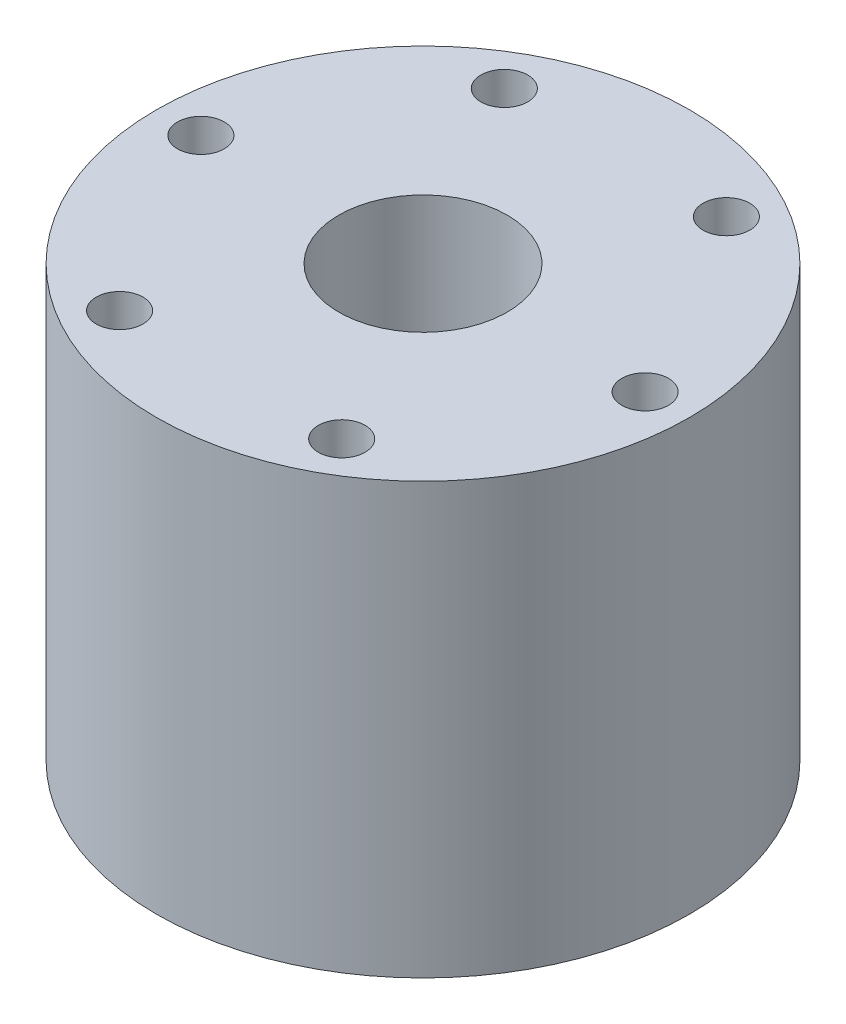
ISO-10303-21;
HEADER;
FILE_DESCRIPTION(('STEP AP214'),'2;1');
FILE_NAME('part.step','',(''),(''),'','','');
FILE_SCHEMA(('AUTOMOTIVE_DESIGN { 1 0 10303 214 1 1 1 1 }'));
ENDSEC;
DATA;
#1=APPLICATION_CONTEXT('core data for automotive mechanical design processes');
#2=APPLICATION_PROTOCOL_DEFINITION('international standard','automotive_design',2000,#1);
#3=PRODUCT_CONTEXT('',#1,'mechanical');
#4=PRODUCT('Part','Part','',(#3));
#5=PRODUCT_RELATED_PRODUCT_CATEGORY('part','',(#4));
#6=PRODUCT_DEFINITION_FORMATION('','',#4);
#7=PRODUCT_DEFINITION_CONTEXT('part definition',#1,'design');
#8=PRODUCT_DEFINITION('design','',#6,#7);
#9=PRODUCT_DEFINITION_SHAPE('','',#8);
#10=(LENGTH_UNIT() NAMED_UNIT(*) SI_UNIT(.MILLI.,.METRE.));
#11=(NAMED_UNIT(*) PLANE_ANGLE_UNIT() SI_UNIT($,.RADIAN.));
#12=(NAMED_UNIT(*) SI_UNIT($,.STERADIAN.) SOLID_ANGLE_UNIT());
#13=UNCERTAINTY_MEASURE_WITH_UNIT(LENGTH_MEASURE(1.E-05),#10,'distance_accuracy_value','');
#14=(GEOMETRIC_REPRESENTATION_CONTEXT(3) GLOBAL_UNCERTAINTY_ASSIGNED_CONTEXT((#13)) GLOBAL_UNIT_ASSIGNED_CONTEXT((#10,
#11,#12)) REPRESENTATION_CONTEXT('',''));
#15=CARTESIAN_POINT('',(0.,0.,0.));
#16=DIRECTION('',(0.,0.,1.));
#17=DIRECTION('',(1.,0.,0.));
#18=AXIS2_PLACEMENT_3D('',#15,#16,#17);
#19=CARTESIAN_POINT('',(0.,-0.07520023066921,-0.004489552551153));
#20=DIRECTION('',(0.,-1.,0.));
#21=DIRECTION('',(0.,0.,-1.));
#22=AXIS2_PLACEMENT_3D('',#19,#20,#21);
#23=CYLINDRICAL_SURFACE('',#22,9.);
#24=CARTESIAN_POINT('',(0.,45.92479976933,-0.004489552551153));
#25=DIRECTION('',(0.,-1.,0.));
#26=DIRECTION('',(0.,0.,-1.));
#27=AXIS2_PLACEMENT_3D('',#24,#25,#26);
#28=CIRCLE('',#27,9.);
#29=CARTESIAN_POINT('',(0.,45.92479976933,-9.00448955255115));
#30=VERTEX_POINT('',#29);
#31=EDGE_CURVE('E17',#30,#30,#28,.T.);
#32=ORIENTED_EDGE('',*,*,#31,.F.);
#33=EDGE_LOOP('',(#32));
#34=FACE_BOUND('',#33,.T.);
#35=CARTESIAN_POINT('',(0.,-0.07520023066921,-0.004489552551153));
#36=DIRECTION('',(0.,-1.,0.));
#37=DIRECTION('',(0.,0.,-1.));
#38=AXIS2_PLACEMENT_3D('',#35,#36,#37);
#39=CIRCLE('',#38,9.);
#40=CARTESIAN_POINT('',(0.,-0.07520023066921,-9.00448955255115));
#41=VERTEX_POINT('',#40);
#42=EDGE_CURVE('E46',#41,#41,#39,.T.);
#43=ORIENTED_EDGE('',*,*,#42,.T.);
#44=EDGE_LOOP('',(#43));
#45=FACE_BOUND('',#44,.T.);
#46=ADVANCED_FACE('F14',(#34,#45),#23,.F.);
#47=CARTESIAN_POINT('',(11.875,-0.07520023066921,-20.57259289243));
#48=DIRECTION('',(0.,-1.,0.));
#49=DIRECTION('',(0.,0.,-1.));
#50=AXIS2_PLACEMENT_3D('',#47,#48,#49);
#51=CYLINDRICAL_SURFACE('',#50,2.5);
#52=CARTESIAN_POINT('',(11.875,45.92479976933,-20.57259289243));
#53=DIRECTION('',(0.,-1.,0.));
#54=DIRECTION('',(0.,0.,-1.));
#55=AXIS2_PLACEMENT_3D('',#52,#53,#54);
#56=CIRCLE('',#55,2.5);
#57=CARTESIAN_POINT('',(11.875,45.92479976933,-23.07259289243));
#58=VERTEX_POINT('',#57);
#59=EDGE_CURVE('E63',#58,#58,#56,.T.);
#60=ORIENTED_EDGE('',*,*,#59,.F.);
#61=EDGE_LOOP('',(#60));
#62=FACE_BOUND('',#61,.T.);
#63=CARTESIAN_POINT('',(11.875,-0.07520023066921,-20.57259289243));
#64=DIRECTION('',(0.,-1.,0.));
#65=DIRECTION('',(0.,0.,-1.));
#66=AXIS2_PLACEMENT_3D('',#63,#64,#65);
#67=CIRCLE('',#66,2.5);
#68=CARTESIAN_POINT('',(11.875,-0.07520023066921,-23.07259289243));
#69=VERTEX_POINT('',#68);
#70=EDGE_CURVE('E43',#69,#69,#67,.T.);
#71=ORIENTED_EDGE('',*,*,#70,.T.);
#72=EDGE_LOOP('',(#71));
#73=FACE_BOUND('',#72,.T.);
#74=ADVANCED_FACE('F75',(#62,#73),#51,.F.);
#75=CARTESIAN_POINT('',(-11.875,-0.07520023066921,-20.57259289243));
#76=DIRECTION('',(0.,-1.,0.));
#77=DIRECTION('',(0.,0.,-1.));
#78=AXIS2_PLACEMENT_3D('',#75,#76,#77);
#79=CYLINDRICAL_SURFACE('',#78,2.5);
#80=CARTESIAN_POINT('',(-11.875,45.92479976933,-20.57259289243));
#81=DIRECTION('',(0.,-1.,0.));
#82=DIRECTION('',(0.,0.,-1.));
#83=AXIS2_PLACEMENT_3D('',#80,#81,#82);
#84=CIRCLE('',#83,2.5);
#85=CARTESIAN_POINT('',(-11.875,45.92479976933,-23.07259289243));
#86=VERTEX_POINT('',#85);
#87=EDGE_CURVE('E61',#86,#86,#84,.T.);
#88=ORIENTED_EDGE('',*,*,#87,.F.);
#89=EDGE_LOOP('',(#88));
#90=FACE_BOUND('',#89,.T.);
#91=CARTESIAN_POINT('',(-11.875,-0.07520023066921,-20.57259289243));
#92=DIRECTION('',(0.,-1.,0.));
#93=DIRECTION('',(0.,0.,-1.));
#94=AXIS2_PLACEMENT_3D('',#91,#92,#93);
#95=CIRCLE('',#94,2.5);
#96=CARTESIAN_POINT('',(-11.875,-0.07520023066921,-23.07259289243));
#97=VERTEX_POINT('',#96);
#98=EDGE_CURVE('E40',#97,#97,#95,.T.);
#99=ORIENTED_EDGE('',*,*,#98,.T.);
#100=EDGE_LOOP('',(#99));
#101=FACE_BOUND('',#100,.T.);
#102=ADVANCED_FACE('F111',(#90,#101),#79,.F.);
#103=CARTESIAN_POINT('',(23.75,-0.07520023066921,-0.004489552551142));
#104=DIRECTION('',(0.,-1.,0.));
#105=DIRECTION('',(0.,0.,-1.));
#106=AXIS2_PLACEMENT_3D('',#103,#104,#105);
#107=CYLINDRICAL_SURFACE('',#106,2.5);
#108=CARTESIAN_POINT('',(23.75,45.92479976933,-0.004489552551142));
#109=DIRECTION('',(0.,-1.,0.));
#110=DIRECTION('',(0.,0.,-1.));
#111=AXIS2_PLACEMENT_3D('',#108,#109,#110);
#112=CIRCLE('',#111,2.5);
#113=CARTESIAN_POINT('',(23.75,45.92479976933,-2.50448955255114));
#114=VERTEX_POINT('',#113);
#115=EDGE_CURVE('E58',#114,#114,#112,.T.);
#116=ORIENTED_EDGE('',*,*,#115,.F.);
#117=EDGE_LOOP('',(#116));
#118=FACE_BOUND('',#117,.T.);
#119=CARTESIAN_POINT('',(23.75,-0.07520023066921,-0.004489552551142));
#120=DIRECTION('',(0.,-1.,0.));
#121=DIRECTION('',(0.,0.,-1.));
#122=AXIS2_PLACEMENT_3D('',#119,#120,#121);
#123=CIRCLE('',#122,2.5);
#124=CARTESIAN_POINT('',(23.75,-0.07520023066921,-2.50448955255114));
#125=VERTEX_POINT('',#124);
#126=EDGE_CURVE('E37',#125,#125,#123,.T.);
#127=ORIENTED_EDGE('',*,*,#126,.T.);
#128=EDGE_LOOP('',(#127));
#129=FACE_BOUND('',#128,.T.);
#130=ADVANCED_FACE('F107',(#118,#129),#107,.F.);
#131=CARTESIAN_POINT('',(11.875,-0.07520023066921,20.56361378733));
#132=DIRECTION('',(0.,-1.,0.));
#133=DIRECTION('',(0.,0.,-1.));
#134=AXIS2_PLACEMENT_3D('',#131,#132,#133);
#135=CYLINDRICAL_SURFACE('',#134,2.5);
#136=CARTESIAN_POINT('',(11.875,45.92479976933,20.56361378733));
#137=DIRECTION('',(0.,-1.,0.));
#138=DIRECTION('',(0.,0.,-1.));
#139=AXIS2_PLACEMENT_3D('',#136,#137,#138);
#140=CIRCLE('',#139,2.5);
#141=CARTESIAN_POINT('',(11.875,45.92479976933,18.06361378733));
#142=VERTEX_POINT('',#141);
#143=EDGE_CURVE('E55',#142,#142,#140,.T.);
#144=ORIENTED_EDGE('',*,*,#143,.F.);
#145=EDGE_LOOP('',(#144));
#146=FACE_BOUND('',#145,.T.);
#147=CARTESIAN_POINT('',(11.875,-0.07520023066921,20.56361378733));
#148=DIRECTION('',(0.,-1.,0.));
#149=DIRECTION('',(0.,0.,-1.));
#150=AXIS2_PLACEMENT_3D('',#147,#148,#149);
#151=CIRCLE('',#150,2.5);
#152=CARTESIAN_POINT('',(11.875,-0.07520023066921,18.06361378733));
#153=VERTEX_POINT('',#152);
#154=EDGE_CURVE('E34',#153,#153,#151,.T.);
#155=ORIENTED_EDGE('',*,*,#154,.T.);
#156=EDGE_LOOP('',(#155));
#157=FACE_BOUND('',#156,.T.);
#158=ADVANCED_FACE('F103',(#146,#157),#135,.F.);
#159=CARTESIAN_POINT('',(-11.875,-0.07520023066921,20.56361378733));
#160=DIRECTION('',(0.,-1.,0.));
#161=DIRECTION('',(0.,0.,-1.));
#162=AXIS2_PLACEMENT_3D('',#159,#160,#161);
#163=CYLINDRICAL_SURFACE('',#162,2.5);
#164=CARTESIAN_POINT('',(-11.875,45.92479976933,20.56361378733));
#165=DIRECTION('',(0.,-1.,0.));
#166=DIRECTION('',(0.,0.,-1.));
#167=AXIS2_PLACEMENT_3D('',#164,#165,#166);
#168=CIRCLE('',#167,2.5);
#169=CARTESIAN_POINT('',(-11.875,45.92479976933,18.06361378733));
#170=VERTEX_POINT('',#169);
#171=EDGE_CURVE('E52',#170,#170,#168,.T.);
#172=ORIENTED_EDGE('',*,*,#171,.F.);
#173=EDGE_LOOP('',(#172));
#174=FACE_BOUND('',#173,.T.);
#175=CARTESIAN_POINT('',(-11.875,-0.07520023066921,20.56361378733));
#176=DIRECTION('',(0.,-1.,0.));
#177=DIRECTION('',(0.,0.,-1.));
#178=AXIS2_PLACEMENT_3D('',#175,#176,#177);
#179=CIRCLE('',#178,2.5);
#180=CARTESIAN_POINT('',(-11.875,-0.07520023066921,18.06361378733));
#181=VERTEX_POINT('',#180);
#182=EDGE_CURVE('E31',#181,#181,#179,.T.);
#183=ORIENTED_EDGE('',*,*,#182,.T.);
#184=EDGE_LOOP('',(#183));
#185=FACE_BOUND('',#184,.T.);
#186=ADVANCED_FACE('F99',(#174,#185),#163,.F.);
#187=CARTESIAN_POINT('',(-23.75,-0.07520023066921,-0.004489552551157));
#188=DIRECTION('',(0.,-1.,0.));
#189=DIRECTION('',(0.,0.,-1.));
#190=AXIS2_PLACEMENT_3D('',#187,#188,#189);
#191=CYLINDRICAL_SURFACE('',#190,2.5);
#192=CARTESIAN_POINT('',(-23.75,45.92479976933,-0.004489552551157));
#193=DIRECTION('',(0.,-1.,0.));
#194=DIRECTION('',(0.,0.,-1.));
#195=AXIS2_PLACEMENT_3D('',#192,#193,#194);
#196=CIRCLE('',#195,2.5);
#197=CARTESIAN_POINT('',(-23.75,45.92479976933,-2.50448955255116));
#198=VERTEX_POINT('',#197);
#199=EDGE_CURVE('E49',#198,#198,#196,.T.);
#200=ORIENTED_EDGE('',*,*,#199,.F.);
#201=EDGE_LOOP('',(#200));
#202=FACE_BOUND('',#201,.T.);
#203=CARTESIAN_POINT('',(-23.75,-0.07520023066921,-0.004489552551157));
#204=DIRECTION('',(0.,-1.,0.));
#205=DIRECTION('',(0.,0.,-1.));
#206=AXIS2_PLACEMENT_3D('',#203,#204,#205);
#207=CIRCLE('',#206,2.5);
#208=CARTESIAN_POINT('',(-23.75,-0.07520023066921,-2.50448955255116));
#209=VERTEX_POINT('',#208);
#210=EDGE_CURVE('E26',#209,#209,#207,.T.);
#211=ORIENTED_EDGE('',*,*,#210,.T.);
#212=EDGE_LOOP('',(#211));
#213=FACE_BOUND('',#212,.T.);
#214=ADVANCED_FACE('F91',(#202,#213),#191,.F.);
#215=CARTESIAN_POINT('',(0.,45.92479976933,0.));
#216=DIRECTION('',(0.,1.,0.));
#217=DIRECTION('',(0.,0.,1.));
#218=AXIS2_PLACEMENT_3D('',#215,#216,#217);
#219=PLANE('',#218);
#220=ORIENTED_EDGE('',*,*,#199,.T.);
#221=EDGE_LOOP('',(#220));
#222=FACE_BOUND('',#221,.T.);
#223=ORIENTED_EDGE('',*,*,#171,.T.);
#224=EDGE_LOOP('',(#223));
#225=FACE_BOUND('',#224,.T.);
#226=ORIENTED_EDGE('',*,*,#143,.T.);
#227=EDGE_LOOP('',(#226));
#228=FACE_BOUND('',#227,.T.);
#229=ORIENTED_EDGE('',*,*,#115,.T.);
#230=EDGE_LOOP('',(#229));
#231=FACE_BOUND('',#230,.T.);
#232=ORIENTED_EDGE('',*,*,#87,.T.);
#233=EDGE_LOOP('',(#232));
#234=FACE_BOUND('',#233,.T.);
#235=ORIENTED_EDGE('',*,*,#59,.T.);
#236=EDGE_LOOP('',(#235));
#237=FACE_BOUND('',#236,.T.);
#238=ORIENTED_EDGE('',*,*,#31,.T.);
#239=EDGE_LOOP('',(#238));
#240=FACE_BOUND('',#239,.T.);
#241=CARTESIAN_POINT('',(0.,45.92479976933,-0.004489552551153));
#242=DIRECTION('',(0.,1.,0.));
#243=DIRECTION('',(0.,0.,1.));
#244=AXIS2_PLACEMENT_3D('',#241,#242,#243);
#245=CIRCLE('',#244,28.5);
#246=CARTESIAN_POINT('',(0.,45.92479976933,28.4955104474488));
#247=VERTEX_POINT('',#246);
#248=EDGE_CURVE('E21',#247,#247,#245,.F.);
#249=ORIENTED_EDGE('',*,*,#248,.F.);
#250=EDGE_LOOP('',(#249));
#251=FACE_BOUND('',#250,.T.);
#252=ADVANCED_FACE('F70',(#222,#225,#228,#231,#234,#237,#240,#251),#219,.T.);
#253=CARTESIAN_POINT('',(0.,-0.07520023066921,0.));
#254=DIRECTION('',(0.,1.,0.));
#255=DIRECTION('',(0.,0.,1.));
#256=AXIS2_PLACEMENT_3D('',#253,#254,#255);
#257=PLANE('',#256);
#258=ORIENTED_EDGE('',*,*,#210,.F.);
#259=EDGE_LOOP('',(#258));
#260=FACE_BOUND('',#259,.T.);
#261=ORIENTED_EDGE('',*,*,#182,.F.);
#262=EDGE_LOOP('',(#261));
#263=FACE_BOUND('',#262,.T.);
#264=ORIENTED_EDGE('',*,*,#154,.F.);
#265=EDGE_LOOP('',(#264));
#266=FACE_BOUND('',#265,.T.);
#267=ORIENTED_EDGE('',*,*,#126,.F.);
#268=EDGE_LOOP('',(#267));
#269=FACE_BOUND('',#268,.T.);
#270=ORIENTED_EDGE('',*,*,#98,.F.);
#271=EDGE_LOOP('',(#270));
#272=FACE_BOUND('',#271,.T.);
#273=ORIENTED_EDGE('',*,*,#70,.F.);
#274=EDGE_LOOP('',(#273));
#275=FACE_BOUND('',#274,.T.);
#276=ORIENTED_EDGE('',*,*,#42,.F.);
#277=EDGE_LOOP('',(#276));
#278=FACE_BOUND('',#277,.T.);
#279=CARTESIAN_POINT('',(0.,-0.07520023066921,-0.004489552551153));
#280=DIRECTION('',(0.,1.,0.));
#281=DIRECTION('',(0.,0.,1.));
#282=AXIS2_PLACEMENT_3D('',#279,#280,#281);
#283=CIRCLE('',#282,28.5);
#284=CARTESIAN_POINT('',(0.,-0.07520023066921,28.4955104474488));
#285=VERTEX_POINT('',#284);
#286=EDGE_CURVE('E10',#285,#285,#283,.T.);
#287=ORIENTED_EDGE('',*,*,#286,.F.);
#288=EDGE_LOOP('',(#287));
#289=FACE_BOUND('',#288,.T.);
#290=ADVANCED_FACE('F78',(#260,#263,#266,#269,#272,#275,#278,#289),#257,.F.);
#291=CARTESIAN_POINT('',(0.,-0.07520023066921,-0.004489552551153));
#292=DIRECTION('',(0.,1.,0.));
#293=DIRECTION('',(0.,0.,1.));
#294=AXIS2_PLACEMENT_3D('',#291,#292,#293);
#295=CYLINDRICAL_SURFACE('',#294,28.5);
#296=ORIENTED_EDGE('',*,*,#248,.T.);
#297=EDGE_LOOP('',(#296));
#298=FACE_BOUND('',#297,.T.);
#299=ORIENTED_EDGE('',*,*,#286,.T.);
#300=EDGE_LOOP('',(#299));
#301=FACE_BOUND('',#300,.T.);
#302=ADVANCED_FACE('F81',(#298,#301),#295,.T.);
#303=CLOSED_SHELL('',(#46,#74,#102,#130,#158,#186,#214,#252,#290,#302));
#304=MANIFOLD_SOLID_BREP('B1',#303);
#305=ADVANCED_BREP_SHAPE_REPRESENTATION('',(#18,#304),#14);
#306=SHAPE_DEFINITION_REPRESENTATION(#9,#305);
ENDSEC;
END-ISO-10303-21;
